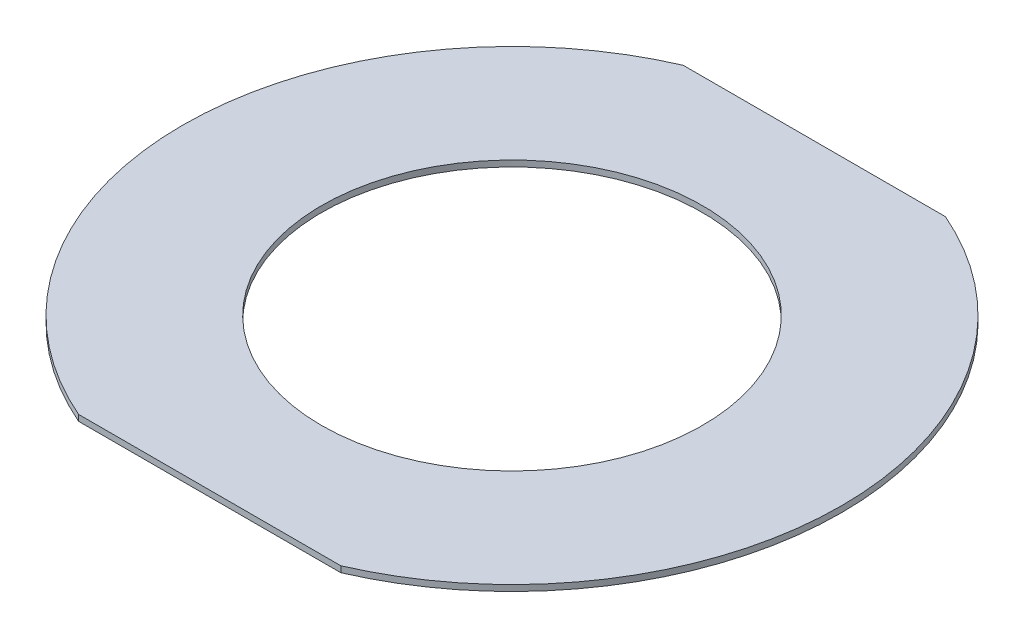
ISO-10303-21;
HEADER;
FILE_DESCRIPTION(('STEP AP214'),'2;1');
FILE_NAME('part.step','',(''),(''),'','','');
FILE_SCHEMA(('AUTOMOTIVE_DESIGN { 1 0 10303 214 1 1 1 1 }'));
ENDSEC;
DATA;
#1=APPLICATION_CONTEXT('core data for automotive mechanical design processes');
#2=APPLICATION_PROTOCOL_DEFINITION('international standard','automotive_design',2000,#1);
#3=PRODUCT_CONTEXT('',#1,'mechanical');
#4=PRODUCT('Part','Part','',(#3));
#5=PRODUCT_RELATED_PRODUCT_CATEGORY('part','',(#4));
#6=PRODUCT_DEFINITION_FORMATION('','',#4);
#7=PRODUCT_DEFINITION_CONTEXT('part definition',#1,'design');
#8=PRODUCT_DEFINITION('design','',#6,#7);
#9=PRODUCT_DEFINITION_SHAPE('','',#8);
#10=(LENGTH_UNIT() NAMED_UNIT(*) SI_UNIT(.MILLI.,.METRE.));
#11=(NAMED_UNIT(*) PLANE_ANGLE_UNIT() SI_UNIT($,.RADIAN.));
#12=(NAMED_UNIT(*) SI_UNIT($,.STERADIAN.) SOLID_ANGLE_UNIT());
#13=UNCERTAINTY_MEASURE_WITH_UNIT(LENGTH_MEASURE(1.E-05),#10,'distance_accuracy_value','');
#14=(GEOMETRIC_REPRESENTATION_CONTEXT(3) GLOBAL_UNCERTAINTY_ASSIGNED_CONTEXT((#13)) GLOBAL_UNIT_ASSIGNED_CONTEXT((#10,
#11,#12)) REPRESENTATION_CONTEXT('',''));
#15=CARTESIAN_POINT('',(0.,0.,0.));
#16=DIRECTION('',(0.,0.,1.));
#17=DIRECTION('',(1.,0.,0.));
#18=AXIS2_PLACEMENT_3D('',#15,#16,#17);
#19=CARTESIAN_POINT('',(0.,0.025400000000007,0.));
#20=DIRECTION('',(0.,1.,0.));
#21=DIRECTION('',(0.,0.,0.999999999999992));
#22=AXIS2_PLACEMENT_3D('',#19,#20,#21);
#23=PLANE('',#22);
#24=CARTESIAN_POINT('',(0.,0.025400000000007,0.));
#25=DIRECTION('',(0.,1.,0.));
#26=DIRECTION('',(0.,0.,0.999999999999992));
#27=AXIS2_PLACEMENT_3D('',#24,#25,#26);
#28=CIRCLE('',#27,1.3843);
#29=CARTESIAN_POINT('',(0.550805310431912,0.0254000000000122,1.26999999999999));
#30=VERTEX_POINT('',#29);
#31=CARTESIAN_POINT('',(0.550805310431918,0.0254000000000087,-1.26999999999999));
#32=VERTEX_POINT('',#31);
#33=EDGE_CURVE('E95',#30,#32,#28,.T.);
#34=ORIENTED_EDGE('',*,*,#33,.T.);
#35=DIRECTION('',(-0.999999999999999,0.,0.));
#36=VECTOR('',#35,1.);
#37=CARTESIAN_POINT('',(-0.550805310431912,0.0254000000000035,-1.26999999999998));
#38=LINE('',#37,#36);
#39=CARTESIAN_POINT('',(-0.550805310431912,0.0254000000000035,-1.26999999999998));
#40=VERTEX_POINT('',#39);
#41=EDGE_CURVE('E90',#32,#40,#38,.T.);
#42=ORIENTED_EDGE('',*,*,#41,.T.);
#43=CARTESIAN_POINT('',(0.,0.025400000000007,0.));
#44=DIRECTION('',(0.,1.,0.));
#45=DIRECTION('',(0.,0.,0.999999999999992));
#46=AXIS2_PLACEMENT_3D('',#43,#44,#45);
#47=CIRCLE('',#46,1.3843);
#48=CARTESIAN_POINT('',(-0.550805310431915,0.025400000000007,1.26999999999999));
#49=VERTEX_POINT('',#48);
#50=EDGE_CURVE('E93',#40,#49,#47,.T.);
#51=ORIENTED_EDGE('',*,*,#50,.T.);
#52=DIRECTION('',(0.999999999999999,0.,0.));
#53=VECTOR('',#52,1.);
#54=CARTESIAN_POINT('',(0.550805310431912,0.0254000000000122,1.26999999999999));
#55=LINE('',#54,#53);
#56=EDGE_CURVE('E60',#49,#30,#55,.T.);
#57=ORIENTED_EDGE('',*,*,#56,.T.);
#58=EDGE_LOOP('',(#34,#42,#51,#57));
#59=FACE_BOUND('',#58,.T.);
#60=CARTESIAN_POINT('',(0.,0.025400000000007,0.));
#61=DIRECTION('',(0.,1.,0.));
#62=DIRECTION('',(0.,0.,0.999999999999992));
#63=AXIS2_PLACEMENT_3D('',#60,#61,#62);
#64=CIRCLE('',#63,0.8001);
#65=CARTESIAN_POINT('',(0.,0.0254000000000079,0.800099999999994));
#66=VERTEX_POINT('',#65);
#67=EDGE_CURVE('E116',#66,#66,#64,.T.);
#68=ORIENTED_EDGE('',*,*,#67,.F.);
#69=EDGE_LOOP('',(#68));
#70=FACE_BOUND('',#69,.T.);
#71=ADVANCED_FACE('F42',(#59,#70),#23,.T.);
#72=CARTESIAN_POINT('',(0.,0.,0.));
#73=DIRECTION('',(0.,1.,0.));
#74=DIRECTION('',(0.,0.,0.999999999999992));
#75=AXIS2_PLACEMENT_3D('',#72,#73,#74);
#76=PLANE('',#75);
#77=CARTESIAN_POINT('',(0.,0.,0.));
#78=DIRECTION('',(0.,1.,0.));
#79=DIRECTION('',(0.,0.,0.999999999999992));
#80=AXIS2_PLACEMENT_3D('',#77,#78,#79);
#81=CIRCLE('',#80,1.3843);
#82=CARTESIAN_POINT('',(0.550805310431912,0.,1.26999999999999));
#83=VERTEX_POINT('',#82);
#84=CARTESIAN_POINT('',(0.550805310431915,0.,-1.26999999999999));
#85=VERTEX_POINT('',#84);
#86=EDGE_CURVE('E112',#83,#85,#81,.T.);
#87=ORIENTED_EDGE('',*,*,#86,.F.);
#88=DIRECTION('',(0.999999999999999,0.,0.));
#89=VECTOR('',#88,1.);
#90=CARTESIAN_POINT('',(0.550805310431912,0.,1.26999999999999));
#91=LINE('',#90,#89);
#92=CARTESIAN_POINT('',(-0.55080531043191,0.,1.26999999999999));
#93=VERTEX_POINT('',#92);
#94=EDGE_CURVE('E83',#93,#83,#91,.T.);
#95=ORIENTED_EDGE('',*,*,#94,.F.);
#96=CARTESIAN_POINT('',(0.,0.,0.));
#97=DIRECTION('',(0.,1.,0.));
#98=DIRECTION('',(0.,0.,0.999999999999992));
#99=AXIS2_PLACEMENT_3D('',#96,#97,#98);
#100=CIRCLE('',#99,1.3843);
#101=CARTESIAN_POINT('',(-0.550805310431913,0.,-1.26999999999998));
#102=VERTEX_POINT('',#101);
#103=EDGE_CURVE('E77',#102,#93,#100,.T.);
#104=ORIENTED_EDGE('',*,*,#103,.F.);
#105=DIRECTION('',(-0.999999999999999,0.,0.));
#106=VECTOR('',#105,1.);
#107=CARTESIAN_POINT('',(-0.550805310431913,0.,-1.26999999999998));
#108=LINE('',#107,#106);
#109=EDGE_CURVE('E100',#85,#102,#108,.T.);
#110=ORIENTED_EDGE('',*,*,#109,.F.);
#111=EDGE_LOOP('',(#87,#95,#104,#110));
#112=FACE_BOUND('',#111,.T.);
#113=CARTESIAN_POINT('',(0.,0.,0.));
#114=DIRECTION('',(0.,1.,0.));
#115=DIRECTION('',(0.,0.,0.999999999999992));
#116=AXIS2_PLACEMENT_3D('',#113,#114,#115);
#117=CIRCLE('',#116,0.8001);
#118=CARTESIAN_POINT('',(0.,0.,0.800099999999993));
#119=VERTEX_POINT('',#118);
#120=EDGE_CURVE('E136',#119,#119,#117,.T.);
#121=ORIENTED_EDGE('',*,*,#120,.T.);
#122=EDGE_LOOP('',(#121));
#123=FACE_BOUND('',#122,.T.);
#124=ADVANCED_FACE('F130',(#112,#123),#76,.F.);
#125=CARTESIAN_POINT('',(0.,0.025400000000007,0.));
#126=DIRECTION('',(0.,-1.,0.));
#127=DIRECTION('',(0.,0.,-0.999999999999992));
#128=AXIS2_PLACEMENT_3D('',#125,#126,#127);
#129=CYLINDRICAL_SURFACE('',#128,1.3843);
#130=ORIENTED_EDGE('',*,*,#86,.T.);
#131=DIRECTION('',(0.,-1.,0.));
#132=VECTOR('',#131,1.);
#133=CARTESIAN_POINT('',(0.550805310431918,0.0254000000000087,-1.26999999999999));
#134=LINE('',#133,#132);
#135=EDGE_CURVE('E11',#32,#85,#134,.T.);
#136=ORIENTED_EDGE('',*,*,#135,.F.);
#137=ORIENTED_EDGE('',*,*,#33,.F.);
#138=DIRECTION('',(0.,-1.,0.));
#139=VECTOR('',#138,1.);
#140=CARTESIAN_POINT('',(0.550805310431912,0.0254000000000122,1.26999999999999));
#141=LINE('',#140,#139);
#142=EDGE_CURVE('E108',#30,#83,#141,.T.);
#143=ORIENTED_EDGE('',*,*,#142,.T.);
#144=EDGE_LOOP('',(#130,#136,#137,#143));
#145=FACE_BOUND('',#144,.T.);
#146=ADVANCED_FACE('F44',(#145),#129,.T.);
#147=CARTESIAN_POINT('',(-0.550805310431912,0.0254000000000035,-1.26999999999998));
#148=DIRECTION('',(0.,0.,0.999999999999992));
#149=DIRECTION('',(1.,0.,0.));
#150=AXIS2_PLACEMENT_3D('',#147,#148,#149);
#151=PLANE('',#150);
#152=ORIENTED_EDGE('',*,*,#109,.T.);
#153=DIRECTION('',(0.,-1.,0.));
#154=VECTOR('',#153,1.);
#155=CARTESIAN_POINT('',(-0.550805310431912,0.0254000000000035,-1.26999999999998));
#156=LINE('',#155,#154);
#157=EDGE_CURVE('E52',#40,#102,#156,.T.);
#158=ORIENTED_EDGE('',*,*,#157,.F.);
#159=ORIENTED_EDGE('',*,*,#41,.F.);
#160=ORIENTED_EDGE('',*,*,#135,.T.);
#161=EDGE_LOOP('',(#152,#158,#159,#160));
#162=FACE_BOUND('',#161,.T.);
#163=ADVANCED_FACE('F99',(#162),#151,.F.);
#164=CARTESIAN_POINT('',(0.,0.025400000000007,0.));
#165=DIRECTION('',(0.,-1.,0.));
#166=DIRECTION('',(0.,0.,-0.999999999999992));
#167=AXIS2_PLACEMENT_3D('',#164,#165,#166);
#168=CYLINDRICAL_SURFACE('',#167,1.3843);
#169=ORIENTED_EDGE('',*,*,#103,.T.);
#170=DIRECTION('',(0.,-1.,0.));
#171=VECTOR('',#170,1.);
#172=CARTESIAN_POINT('',(-0.550805310431915,0.025400000000007,1.26999999999999));
#173=LINE('',#172,#171);
#174=EDGE_CURVE('E102',#49,#93,#173,.T.);
#175=ORIENTED_EDGE('',*,*,#174,.F.);
#176=ORIENTED_EDGE('',*,*,#50,.F.);
#177=ORIENTED_EDGE('',*,*,#157,.T.);
#178=EDGE_LOOP('',(#169,#175,#176,#177));
#179=FACE_BOUND('',#178,.T.);
#180=ADVANCED_FACE('F103',(#179),#168,.T.);
#181=CARTESIAN_POINT('',(0.550805310431912,0.0254000000000122,1.26999999999999));
#182=DIRECTION('',(0.,0.,-0.999999999999992));
#183=DIRECTION('',(-1.,0.,0.));
#184=AXIS2_PLACEMENT_3D('',#181,#182,#183);
#185=PLANE('',#184);
#186=ORIENTED_EDGE('',*,*,#94,.T.);
#187=ORIENTED_EDGE('',*,*,#142,.F.);
#188=ORIENTED_EDGE('',*,*,#56,.F.);
#189=ORIENTED_EDGE('',*,*,#174,.T.);
#190=EDGE_LOOP('',(#186,#187,#188,#189));
#191=FACE_BOUND('',#190,.T.);
#192=ADVANCED_FACE('F127',(#191),#185,.F.);
#193=CARTESIAN_POINT('',(0.,0.025400000000007,0.));
#194=DIRECTION('',(0.,-1.,0.));
#195=DIRECTION('',(0.,0.,-0.999999999999992));
#196=AXIS2_PLACEMENT_3D('',#193,#194,#195);
#197=CYLINDRICAL_SURFACE('',#196,0.8001);
#198=ORIENTED_EDGE('',*,*,#67,.T.);
#199=EDGE_LOOP('',(#198));
#200=FACE_BOUND('',#199,.T.);
#201=ORIENTED_EDGE('',*,*,#120,.F.);
#202=EDGE_LOOP('',(#201));
#203=FACE_BOUND('',#202,.T.);
#204=ADVANCED_FACE('F145',(#200,#203),#197,.F.);
#205=CLOSED_SHELL('',(#71,#124,#146,#163,#180,#192,#204));
#206=MANIFOLD_SOLID_BREP('B2',#205);
#207=ADVANCED_BREP_SHAPE_REPRESENTATION('',(#18,#206),#14);
#208=SHAPE_DEFINITION_REPRESENTATION(#9,#207);
ENDSEC;
END-ISO-10303-21;
